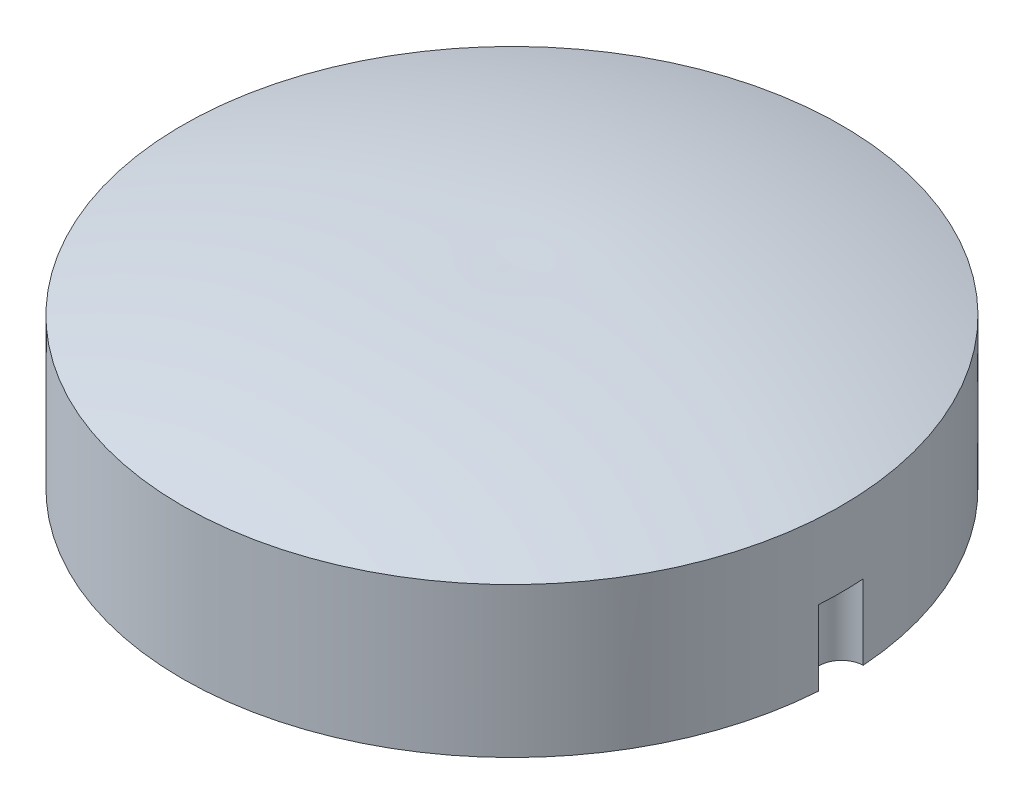
ISO-10303-21;
HEADER;
FILE_DESCRIPTION(('STEP AP214'),'2;1');
FILE_NAME('part.step','',(''),(''),'','','');
FILE_SCHEMA(('AUTOMOTIVE_DESIGN { 1 0 10303 214 1 1 1 1 }'));
ENDSEC;
DATA;
#1=APPLICATION_CONTEXT('core data for automotive mechanical design processes');
#2=APPLICATION_PROTOCOL_DEFINITION('international standard','automotive_design',2000,#1);
#3=PRODUCT_CONTEXT('',#1,'mechanical');
#4=PRODUCT('Part','Part','',(#3));
#5=PRODUCT_RELATED_PRODUCT_CATEGORY('part','',(#4));
#6=PRODUCT_DEFINITION_FORMATION('','',#4);
#7=PRODUCT_DEFINITION_CONTEXT('part definition',#1,'design');
#8=PRODUCT_DEFINITION('design','',#6,#7);
#9=PRODUCT_DEFINITION_SHAPE('','',#8);
#10=(LENGTH_UNIT() NAMED_UNIT(*) SI_UNIT(.MILLI.,.METRE.));
#11=(NAMED_UNIT(*) PLANE_ANGLE_UNIT() SI_UNIT($,.RADIAN.));
#12=(NAMED_UNIT(*) SI_UNIT($,.STERADIAN.) SOLID_ANGLE_UNIT());
#13=UNCERTAINTY_MEASURE_WITH_UNIT(LENGTH_MEASURE(1.E-05),#10,'distance_accuracy_value','');
#14=(GEOMETRIC_REPRESENTATION_CONTEXT(3) GLOBAL_UNCERTAINTY_ASSIGNED_CONTEXT((#13)) GLOBAL_UNIT_ASSIGNED_CONTEXT((#10,
#11,#12)) REPRESENTATION_CONTEXT('',''));
#15=CARTESIAN_POINT('',(0.,0.,0.));
#16=DIRECTION('',(0.,0.,1.));
#17=DIRECTION('',(1.,0.,0.));
#18=AXIS2_PLACEMENT_3D('',#15,#16,#17);
#19=CARTESIAN_POINT('',(0.,-51.3737472667072,2.42630719090357));
#20=DIRECTION('',(-1.,0.,0.));
#21=DIRECTION('',(0.,0.,1.));
#22=AXIS2_PLACEMENT_3D('',#19,#20,#21);
#23=CIRCLE('',#22,64.4194559410627);
#24=TRIMMED_CURVE('',#23,(PARAMETER_VALUE(-1.60846943623941)),
(PARAMETER_VALUE(1.60846943623941)),.T.,.PARAMETER.);
#25=CARTESIAN_POINT('',(0.,-51.3737472667072,0.));
#26=DIRECTION('',(0.,1.,0.));
#27=AXIS1_PLACEMENT('',#25,#26);
#28=SURFACE_OF_REVOLUTION('',#24,#27);
#29=CARTESIAN_POINT('',(0.,13.,0.));
#30=VERTEX_POINT('',#29);
#31=VERTEX_LOOP('',#30);
#32=FACE_BOUND('',#31,.T.);
#33=CARTESIAN_POINT('',(0.,10.,0.));
#34=DIRECTION('',(0.,1.,0.));
#35=DIRECTION('',(0.,0.,1.));
#36=AXIS2_PLACEMENT_3D('',#33,#34,#35);
#37=CIRCLE('',#36,22.);
#38=CARTESIAN_POINT('',(0.,10.,22.));
#39=VERTEX_POINT('',#38);
#40=EDGE_CURVE('E39',#39,#39,#37,.T.);
#41=ORIENTED_EDGE('',*,*,#40,.T.);
#42=EDGE_LOOP('',(#41));
#43=FACE_BOUND('',#42,.T.);
#44=ADVANCED_FACE('F32',(#32,#43),#28,.T.);
#45=CARTESIAN_POINT('',(0.,28.3049645390071,0.));
#46=DIRECTION('',(0.,1.,0.));
#47=DIRECTION('',(0.,0.,1.));
#48=AXIS2_PLACEMENT_3D('',#45,#46,#47);
#49=CYLINDRICAL_SURFACE('',#48,22.);
#50=ORIENTED_EDGE('',*,*,#40,.F.);
#51=EDGE_LOOP('',(#50));
#52=FACE_BOUND('',#51,.T.);
#53=CARTESIAN_POINT('',(0.,5.,0.));
#54=DIRECTION('',(0.,-1.,0.));
#55=DIRECTION('',(0.,0.,-1.));
#56=AXIS2_PLACEMENT_3D('',#53,#54,#55);
#57=CIRCLE('',#56,22.);
#58=CARTESIAN_POINT('',(21.9488636363636,5.,-1.49912810403716));
#59=VERTEX_POINT('',#58);
#60=CARTESIAN_POINT('',(21.9488636363636,5.,1.49912810403716));
#61=VERTEX_POINT('',#60);
#62=EDGE_CURVE('E11',#59,#61,#57,.T.);
#63=ORIENTED_EDGE('',*,*,#62,.F.);
#64=DIRECTION('',(0.,-1.,0.));
#65=VECTOR('',#64,1.);
#66=CARTESIAN_POINT('',(21.9488636363636,2.5,-1.49912810403716));
#67=LINE('',#66,#65);
#68=CARTESIAN_POINT('',(21.9488636363636,0.,-1.49912810403716));
#69=VERTEX_POINT('',#68);
#70=EDGE_CURVE('E65',#59,#69,#67,.T.);
#71=ORIENTED_EDGE('',*,*,#70,.T.);
#72=CARTESIAN_POINT('',(0.,0.,0.));
#73=DIRECTION('',(0.,1.,0.));
#74=DIRECTION('',(0.,0.,1.));
#75=AXIS2_PLACEMENT_3D('',#72,#73,#74);
#76=CIRCLE('',#75,22.);
#77=CARTESIAN_POINT('',(21.9488636363636,0.,1.49912810403717));
#78=VERTEX_POINT('',#77);
#79=EDGE_CURVE('E71',#69,#78,#76,.T.);
#80=ORIENTED_EDGE('',*,*,#79,.T.);
#81=DIRECTION('',(0.,-1.,0.));
#82=VECTOR('',#81,1.);
#83=CARTESIAN_POINT('',(21.9488636363636,2.5,1.49912810403716));
#84=LINE('',#83,#82);
#85=EDGE_CURVE('E46',#78,#61,#84,.F.);
#86=ORIENTED_EDGE('',*,*,#85,.T.);
#87=EDGE_LOOP('',(#63,#71,#80,#86));
#88=FACE_BOUND('',#87,.T.);
#89=ADVANCED_FACE('F69',(#52,#88),#49,.T.);
#90=CARTESIAN_POINT('',(0.,0.,0.));
#91=DIRECTION('',(0.,1.,0.));
#92=DIRECTION('',(0.,0.,1.));
#93=AXIS2_PLACEMENT_3D('',#90,#91,#92);
#94=PLANE('',#93);
#95=ORIENTED_EDGE('',*,*,#79,.F.);
#96=CARTESIAN_POINT('',(22.,0.,0.));
#97=DIRECTION('',(0.,-1.,0.));
#98=DIRECTION('',(0.,0.,-1.));
#99=AXIS2_PLACEMENT_3D('',#96,#97,#98);
#100=CIRCLE('',#99,1.5);
#101=EDGE_CURVE('E66',#78,#69,#100,.T.);
#102=ORIENTED_EDGE('',*,*,#101,.F.);
#103=EDGE_LOOP('',(#95,#102));
#104=FACE_BOUND('',#103,.T.);
#105=ADVANCED_FACE('F81',(#104),#94,.F.);
#106=CARTESIAN_POINT('',(22.,5.,0.));
#107=DIRECTION('',(0.,-1.,0.));
#108=DIRECTION('',(0.,0.,-1.));
#109=AXIS2_PLACEMENT_3D('',#106,#107,#108);
#110=PLANE('',#109);
#111=ORIENTED_EDGE('',*,*,#62,.T.);
#112=CARTESIAN_POINT('',(22.,5.,0.));
#113=DIRECTION('',(0.,-1.,0.));
#114=DIRECTION('',(0.,0.,-1.));
#115=AXIS2_PLACEMENT_3D('',#112,#113,#114);
#116=CIRCLE('',#115,1.5);
#117=EDGE_CURVE('E61',#61,#59,#116,.T.);
#118=ORIENTED_EDGE('',*,*,#117,.T.);
#119=EDGE_LOOP('',(#111,#118));
#120=FACE_BOUND('',#119,.T.);
#121=ADVANCED_FACE('F60',(#120),#110,.T.);
#122=CARTESIAN_POINT('',(22.,5.,0.));
#123=DIRECTION('',(0.,-1.,0.));
#124=DIRECTION('',(0.,0.,-1.));
#125=AXIS2_PLACEMENT_3D('',#122,#123,#124);
#126=CYLINDRICAL_SURFACE('',#125,1.5);
#127=ORIENTED_EDGE('',*,*,#117,.F.);
#128=ORIENTED_EDGE('',*,*,#85,.F.);
#129=ORIENTED_EDGE('',*,*,#101,.T.);
#130=ORIENTED_EDGE('',*,*,#70,.F.);
#131=EDGE_LOOP('',(#127,#128,#129,#130));
#132=FACE_BOUND('',#131,.T.);
#133=ADVANCED_FACE('F64',(#132),#126,.F.);
#134=CLOSED_SHELL('',(#44,#89,#105,#121,#133));
#135=MANIFOLD_SOLID_BREP('B2',#134);
#136=ADVANCED_BREP_SHAPE_REPRESENTATION('',(#18,#135),#14);
#137=SHAPE_DEFINITION_REPRESENTATION(#9,#136);
ENDSEC;
END-ISO-10303-21;
